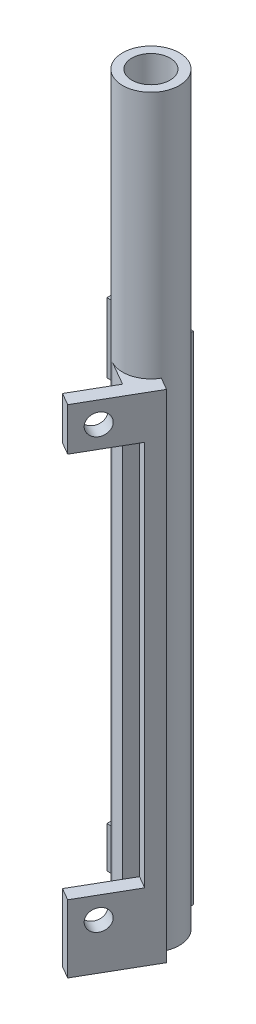
ISO-10303-21;
HEADER;
FILE_DESCRIPTION(('STEP AP214'),'2;1');
FILE_NAME('part.step','',(''),(''),'','','');
FILE_SCHEMA(('AUTOMOTIVE_DESIGN { 1 0 10303 214 1 1 1 1 }'));
ENDSEC;
DATA;
#1=APPLICATION_CONTEXT('core data for automotive mechanical design processes');
#2=APPLICATION_PROTOCOL_DEFINITION('international standard','automotive_design',2000,#1);
#3=PRODUCT_CONTEXT('',#1,'mechanical');
#4=PRODUCT('Part','Part','',(#3));
#5=PRODUCT_RELATED_PRODUCT_CATEGORY('part','',(#4));
#6=PRODUCT_DEFINITION_FORMATION('','',#4);
#7=PRODUCT_DEFINITION_CONTEXT('part definition',#1,'design');
#8=PRODUCT_DEFINITION('design','',#6,#7);
#9=PRODUCT_DEFINITION_SHAPE('','',#8);
#10=(LENGTH_UNIT() NAMED_UNIT(*) SI_UNIT(.MILLI.,.METRE.));
#11=(NAMED_UNIT(*) PLANE_ANGLE_UNIT() SI_UNIT($,.RADIAN.));
#12=(NAMED_UNIT(*) SI_UNIT($,.STERADIAN.) SOLID_ANGLE_UNIT());
#13=UNCERTAINTY_MEASURE_WITH_UNIT(LENGTH_MEASURE(1.E-05),#10,'distance_accuracy_value','');
#14=(GEOMETRIC_REPRESENTATION_CONTEXT(3) GLOBAL_UNCERTAINTY_ASSIGNED_CONTEXT((#13)) GLOBAL_UNIT_ASSIGNED_CONTEXT((#10,
#11,#12)) REPRESENTATION_CONTEXT('',''));
#15=CARTESIAN_POINT('',(0.,0.,0.));
#16=DIRECTION('',(0.,0.,1.));
#17=DIRECTION('',(1.,0.,0.));
#18=AXIS2_PLACEMENT_3D('',#15,#16,#17);
#19=CARTESIAN_POINT('',(4.39940905122498,0.,2.54000000000002));
#20=DIRECTION('',(0.866025403784439,0.,0.5));
#21=DIRECTION('',(0.5,0.,-0.866025403784438));
#22=AXIS2_PLACEMENT_3D('',#19,#20,#21);
#23=PLANE('',#22);
#24=CARTESIAN_POINT('',(-0.0455909487750237,85.09,10.2389658396437));
#25=DIRECTION('',(0.866025403784439,0.,0.5));
#26=DIRECTION('',(0.5,0.,-0.866025403784438));
#27=AXIS2_PLACEMENT_3D('',#24,#25,#26);
#28=CIRCLE('',#27,1.90500000000001);
#29=CARTESIAN_POINT('',(0.906909051224983,85.09,8.5891874454343));
#30=VERTEX_POINT('',#29);
#31=EDGE_CURVE('E40',#30,#30,#28,.T.);
#32=ORIENTED_EDGE('',*,*,#31,.T.);
#33=EDGE_LOOP('',(#32));
#34=FACE_BOUND('',#33,.T.);
#35=DIRECTION('',(0.,-1.,0.));
#36=VECTOR('',#35,1.);
#37=CARTESIAN_POINT('',(1.85940905122498,0.,6.93940905122495));
#38=LINE('',#37,#36);
#39=CARTESIAN_POINT('',(1.85940905122498,88.9,6.93940905122495));
#40=VERTEX_POINT('',#39);
#41=CARTESIAN_POINT('',(1.85940905122495,81.2165,6.93940905122493));
#42=VERTEX_POINT('',#41);
#43=EDGE_CURVE('E286',#40,#42,#38,.T.);
#44=ORIENTED_EDGE('',*,*,#43,.T.);
#45=DIRECTION('',(-0.499999999999998,0.,0.86602540378444));
#46=VECTOR('',#45,1.);
#47=CARTESIAN_POINT('',(-2.07759094877504,81.2165,13.7584930806236));
#48=LINE('',#47,#46);
#49=CARTESIAN_POINT('',(-2.07759094877504,81.2165,13.7584930806236));
#50=VERTEX_POINT('',#49);
#51=EDGE_CURVE('E210',#42,#50,#48,.T.);
#52=ORIENTED_EDGE('',*,*,#51,.T.);
#53=DIRECTION('',(0.,-1.,0.));
#54=VECTOR('',#53,1.);
#55=CARTESIAN_POINT('',(-2.07759094877502,0.,13.7584930806236));
#56=LINE('',#55,#54);
#57=CARTESIAN_POINT('',(-2.07759094877502,88.9,13.7584930806236));
#58=VERTEX_POINT('',#57);
#59=EDGE_CURVE('E279',#58,#50,#56,.T.);
#60=ORIENTED_EDGE('',*,*,#59,.F.);
#61=DIRECTION('',(0.5,0.,-0.866025403784438));
#62=VECTOR('',#61,1.);
#63=CARTESIAN_POINT('',(1.85940905122498,88.9,6.93940905122495));
#64=LINE('',#63,#62);
#65=EDGE_CURVE('E292',#58,#40,#64,.T.);
#66=ORIENTED_EDGE('',*,*,#65,.T.);
#67=EDGE_LOOP('',(#44,#52,#60,#66));
#68=FACE_BOUND('',#67,.T.);
#69=ADVANCED_FACE('F36',(#34,#68),#23,.F.);
#70=CARTESIAN_POINT('',(-6.47699999999999,0.,11.2184930806236));
#71=DIRECTION('',(-0.499999999999999,0.,0.866025403784439));
#72=DIRECTION('',(0.866025403784439,0.,0.499999999999999));
#73=AXIS2_PLACEMENT_3D('',#70,#71,#72);
#74=PLANE('',#73);
#75=DIRECTION('',(0.86602540378444,0.,0.499999999999998));
#76=VECTOR('',#75,1.);
#77=CARTESIAN_POINT('',(-2.07759094877504,81.2165,13.7584930806236));
#78=LINE('',#77,#76);
#79=CARTESIAN_POINT('',(0.122113576837438,81.2165,15.0284930806236));
#80=VERTEX_POINT('',#79);
#81=EDGE_CURVE('E220',#50,#80,#78,.T.);
#82=ORIENTED_EDGE('',*,*,#81,.T.);
#83=DIRECTION('',(0.,1.,0.));
#84=VECTOR('',#83,1.);
#85=CARTESIAN_POINT('',(0.122113576837431,0.,15.0284930806236));
#86=LINE('',#85,#84);
#87=CARTESIAN_POINT('',(0.122113576837425,88.9,15.0284930806236));
#88=VERTEX_POINT('',#87);
#89=EDGE_CURVE('E271',#80,#88,#86,.T.);
#90=ORIENTED_EDGE('',*,*,#89,.T.);
#91=DIRECTION('',(-0.866025403784439,0.,-0.499999999999999));
#92=VECTOR('',#91,1.);
#93=CARTESIAN_POINT('',(0.122113576837425,88.9,15.0284930806236));
#94=LINE('',#93,#92);
#95=EDGE_CURVE('E275',#88,#58,#94,.T.);
#96=ORIENTED_EDGE('',*,*,#95,.T.);
#97=ORIENTED_EDGE('',*,*,#59,.T.);
#98=EDGE_LOOP('',(#82,#90,#96,#97));
#99=FACE_BOUND('',#98,.T.);
#100=ADVANCED_FACE('F401',(#99),#74,.T.);
#101=CARTESIAN_POINT('',(0.,0.,-5.08));
#102=DIRECTION('',(0.,0.,1.));
#103=DIRECTION('',(1.,0.,0.));
#104=AXIS2_PLACEMENT_3D('',#101,#102,#103);
#105=PLANE('',#104);
#106=DIRECTION('',(-1.,0.,0.));
#107=VECTOR('',#106,1.);
#108=CARTESIAN_POINT('',(-12.954,76.454,-5.08));
#109=LINE('',#108,#107);
#110=CARTESIAN_POINT('',(-5.08,76.454,-5.08));
#111=VERTEX_POINT('',#110);
#112=CARTESIAN_POINT('',(-12.954,76.454,-5.08));
#113=VERTEX_POINT('',#112);
#114=EDGE_CURVE('E242',#111,#113,#109,.T.);
#115=ORIENTED_EDGE('',*,*,#114,.F.);
#116=DIRECTION('',(0.,1.,0.));
#117=VECTOR('',#116,1.);
#118=CARTESIAN_POINT('',(-5.08000000000001,88.9,-5.08));
#119=LINE('',#118,#117);
#120=CARTESIAN_POINT('',(-5.08000000000001,88.9,-5.08));
#121=VERTEX_POINT('',#120);
#122=EDGE_CURVE('E301',#111,#121,#119,.T.);
#123=ORIENTED_EDGE('',*,*,#122,.T.);
#124=DIRECTION('',(-1.,0.,0.));
#125=VECTOR('',#124,1.);
#126=CARTESIAN_POINT('',(-11.684,88.9,-5.08));
#127=LINE('',#126,#125);
#128=CARTESIAN_POINT('',(-12.954,88.9,-5.08));
#129=VERTEX_POINT('',#128);
#130=EDGE_CURVE('E305',#121,#129,#127,.T.);
#131=ORIENTED_EDGE('',*,*,#130,.T.);
#132=DIRECTION('',(0.,1.,0.));
#133=VECTOR('',#132,1.);
#134=CARTESIAN_POINT('',(-12.954,0.,-5.08));
#135=LINE('',#134,#133);
#136=EDGE_CURVE('E257',#113,#129,#135,.T.);
#137=ORIENTED_EDGE('',*,*,#136,.F.);
#138=EDGE_LOOP('',(#115,#123,#131,#137));
#139=FACE_BOUND('',#138,.T.);
#140=CARTESIAN_POINT('',(-8.89,80.01,-5.08));
#141=DIRECTION('',(0.,0.,1.));
#142=DIRECTION('',(1.,0.,0.));
#143=AXIS2_PLACEMENT_3D('',#140,#141,#142);
#144=CIRCLE('',#143,1.90500000000002);
#145=CARTESIAN_POINT('',(-6.98499999999998,80.01,-5.08));
#146=VERTEX_POINT('',#145);
#147=EDGE_CURVE('E308',#146,#146,#144,.F.);
#148=ORIENTED_EDGE('',*,*,#147,.T.);
#149=EDGE_LOOP('',(#148));
#150=FACE_BOUND('',#149,.T.);
#151=ADVANCED_FACE('F383',(#139,#150),#105,.T.);
#152=CARTESIAN_POINT('',(-12.954,0.,0.));
#153=DIRECTION('',(-1.,0.,0.));
#154=DIRECTION('',(0.,0.,1.));
#155=AXIS2_PLACEMENT_3D('',#152,#153,#154);
#156=PLANE('',#155);
#157=DIRECTION('',(0.,0.,1.));
#158=VECTOR('',#157,1.);
#159=CARTESIAN_POINT('',(-12.954,76.454,-7.62));
#160=LINE('',#159,#158);
#161=CARTESIAN_POINT('',(-12.954,76.454,-7.62));
#162=VERTEX_POINT('',#161);
#163=EDGE_CURVE('E245',#162,#113,#160,.T.);
#164=ORIENTED_EDGE('',*,*,#163,.T.);
#165=ORIENTED_EDGE('',*,*,#136,.T.);
#166=DIRECTION('',(0.,0.,-1.));
#167=VECTOR('',#166,1.);
#168=CARTESIAN_POINT('',(-12.954,88.9,-5.08));
#169=LINE('',#168,#167);
#170=CARTESIAN_POINT('',(-12.954,88.9,-7.62));
#171=VERTEX_POINT('',#170);
#172=EDGE_CURVE('E261',#129,#171,#169,.T.);
#173=ORIENTED_EDGE('',*,*,#172,.T.);
#174=DIRECTION('',(0.,-1.,0.));
#175=VECTOR('',#174,1.);
#176=CARTESIAN_POINT('',(-12.954,0.,-7.62));
#177=LINE('',#176,#175);
#178=EDGE_CURVE('E265',#171,#162,#177,.T.);
#179=ORIENTED_EDGE('',*,*,#178,.T.);
#180=EDGE_LOOP('',(#164,#165,#173,#179));
#181=FACE_BOUND('',#180,.T.);
#182=ADVANCED_FACE('F396',(#181),#156,.T.);
#183=CARTESIAN_POINT('',(-8.89,3.81,-10.161));
#184=DIRECTION('',(0.,0.,1.));
#185=DIRECTION('',(1.,0.,0.));
#186=AXIS2_PLACEMENT_3D('',#183,#184,#185);
#187=CYLINDRICAL_SURFACE('',#186,1.905);
#188=CARTESIAN_POINT('',(-8.89,3.81,-7.62));
#189=DIRECTION('',(0.,0.,1.));
#190=DIRECTION('',(1.,0.,0.));
#191=AXIS2_PLACEMENT_3D('',#188,#189,#190);
#192=CIRCLE('',#191,1.905);
#193=CARTESIAN_POINT('',(-6.985,3.81,-7.62));
#194=VERTEX_POINT('',#193);
#195=EDGE_CURVE('E331',#194,#194,#192,.F.);
#196=ORIENTED_EDGE('',*,*,#195,.T.);
#197=EDGE_LOOP('',(#196));
#198=FACE_BOUND('',#197,.T.);
#199=CARTESIAN_POINT('',(-8.89,3.81,-5.08));
#200=DIRECTION('',(0.,0.,1.));
#201=DIRECTION('',(1.,0.,0.));
#202=AXIS2_PLACEMENT_3D('',#199,#200,#201);
#203=CIRCLE('',#202,1.905);
#204=CARTESIAN_POINT('',(-6.985,3.81,-5.08));
#205=VERTEX_POINT('',#204);
#206=EDGE_CURVE('E309',#205,#205,#203,.F.);
#207=ORIENTED_EDGE('',*,*,#206,.F.);
#208=EDGE_LOOP('',(#207));
#209=FACE_BOUND('',#208,.T.);
#210=ADVANCED_FACE('F387',(#198,#209),#187,.F.);
#211=CARTESIAN_POINT('',(-8.89,80.01,-10.161));
#212=DIRECTION('',(0.,0.,1.));
#213=DIRECTION('',(1.,0.,0.));
#214=AXIS2_PLACEMENT_3D('',#211,#212,#213);
#215=CYLINDRICAL_SURFACE('',#214,1.90500000000002);
#216=CARTESIAN_POINT('',(-8.89,80.01,-7.62));
#217=DIRECTION('',(0.,0.,1.));
#218=DIRECTION('',(1.,0.,0.));
#219=AXIS2_PLACEMENT_3D('',#216,#217,#218);
#220=CIRCLE('',#219,1.90500000000002);
#221=CARTESIAN_POINT('',(-6.98499999999998,80.01,-7.62));
#222=VERTEX_POINT('',#221);
#223=EDGE_CURVE('E330',#222,#222,#220,.F.);
#224=ORIENTED_EDGE('',*,*,#223,.T.);
#225=EDGE_LOOP('',(#224));
#226=FACE_BOUND('',#225,.T.);
#227=ORIENTED_EDGE('',*,*,#147,.F.);
#228=EDGE_LOOP('',(#227));
#229=FACE_BOUND('',#228,.T.);
#230=ADVANCED_FACE('F385',(#226,#229),#215,.F.);
#231=CARTESIAN_POINT('',(0.,133.35,0.));
#232=DIRECTION('',(0.,-1.,0.));
#233=DIRECTION('',(0.,0.,-1.));
#234=AXIS2_PLACEMENT_3D('',#231,#232,#233);
#235=CYLINDRICAL_SURFACE('',#234,5.08);
#236=DIRECTION('',(0.,-1.,0.));
#237=VECTOR('',#236,1.);
#238=CARTESIAN_POINT('',(0.,88.9,-5.08));
#239=LINE('',#238,#237);
#240=CARTESIAN_POINT('',(0.,88.9,-5.08));
#241=VERTEX_POINT('',#240);
#242=CARTESIAN_POINT('',(0.,0.,-5.08));
#243=VERTEX_POINT('',#242);
#244=EDGE_CURVE('E355',#241,#243,#239,.T.);
#245=ORIENTED_EDGE('',*,*,#244,.F.);
#246=CARTESIAN_POINT('',(0.,88.9,0.));
#247=DIRECTION('',(0.,1.,0.));
#248=DIRECTION('',(0.,0.,1.));
#249=AXIS2_PLACEMENT_3D('',#246,#247,#248);
#250=CIRCLE('',#249,5.08);
#251=CARTESIAN_POINT('',(-5.08,88.9,0.));
#252=VERTEX_POINT('',#251);
#253=EDGE_CURVE('E367',#241,#252,#250,.T.);
#254=ORIENTED_EDGE('',*,*,#253,.T.);
#255=DIRECTION('',(0.,-1.,0.));
#256=VECTOR('',#255,1.);
#257=CARTESIAN_POINT('',(-5.08,88.9,0.));
#258=LINE('',#257,#256);
#259=CARTESIAN_POINT('',(-5.08,0.,0.));
#260=VERTEX_POINT('',#259);
#261=EDGE_CURVE('E359',#252,#260,#258,.T.);
#262=ORIENTED_EDGE('',*,*,#261,.T.);
#263=CARTESIAN_POINT('',(0.,0.,0.));
#264=DIRECTION('',(0.,1.,0.));
#265=DIRECTION('',(0.,0.,1.));
#266=AXIS2_PLACEMENT_3D('',#263,#264,#265);
#267=CIRCLE('',#266,5.08);
#268=CARTESIAN_POINT('',(-2.53999999999999,0.,4.39940905122496));
#269=VERTEX_POINT('',#268);
#270=EDGE_CURVE('E371',#260,#269,#267,.T.);
#271=ORIENTED_EDGE('',*,*,#270,.T.);
#272=DIRECTION('',(0.,-1.,0.));
#273=VECTOR('',#272,1.);
#274=CARTESIAN_POINT('',(-2.53999999999998,88.9,4.39940905122496));
#275=LINE('',#274,#273);
#276=CARTESIAN_POINT('',(-2.53999999999998,88.9,4.39940905122496));
#277=VERTEX_POINT('',#276);
#278=EDGE_CURVE('E362',#277,#269,#275,.T.);
#279=ORIENTED_EDGE('',*,*,#278,.F.);
#280=CARTESIAN_POINT('',(4.39940905122495,88.9,2.53999999999999));
#281=VERTEX_POINT('',#280);
#282=EDGE_CURVE('E358',#277,#281,#250,.T.);
#283=ORIENTED_EDGE('',*,*,#282,.T.);
#284=DIRECTION('',(0.,-1.,0.));
#285=VECTOR('',#284,1.);
#286=CARTESIAN_POINT('',(4.39940905122493,88.9,2.53999999999998));
#287=LINE('',#286,#285);
#288=CARTESIAN_POINT('',(4.39940905122493,0.,2.53999999999998));
#289=VERTEX_POINT('',#288);
#290=EDGE_CURVE('E351',#281,#289,#287,.T.);
#291=ORIENTED_EDGE('',*,*,#290,.T.);
#292=EDGE_CURVE('E45',#289,#243,#267,.T.);
#293=ORIENTED_EDGE('',*,*,#292,.T.);
#294=EDGE_LOOP('',(#245,#254,#262,#271,#279,#283,#291,#293));
#295=FACE_BOUND('',#294,.T.);
#296=CARTESIAN_POINT('',(0.,133.35,0.));
#297=DIRECTION('',(0.,1.,0.));
#298=DIRECTION('',(0.,0.,1.));
#299=AXIS2_PLACEMENT_3D('',#296,#297,#298);
#300=CIRCLE('',#299,5.08);
#301=CARTESIAN_POINT('',(0.,133.35,5.08));
#302=VERTEX_POINT('',#301);
#303=EDGE_CURVE('E11',#302,#302,#300,.T.);
#304=ORIENTED_EDGE('',*,*,#303,.F.);
#305=EDGE_LOOP('',(#304));
#306=FACE_BOUND('',#305,.T.);
#307=ADVANCED_FACE('F38',(#295,#306),#235,.T.);
#308=CARTESIAN_POINT('',(0.,133.35,0.));
#309=DIRECTION('',(0.,1.,0.));
#310=DIRECTION('',(0.,0.,1.));
#311=AXIS2_PLACEMENT_3D('',#308,#309,#310);
#312=PLANE('',#311);
#313=CARTESIAN_POINT('',(0.,133.35,0.));
#314=DIRECTION('',(0.,-1.,0.));
#315=DIRECTION('',(0.,0.,-1.));
#316=AXIS2_PLACEMENT_3D('',#313,#314,#315);
#317=CIRCLE('',#316,3.429);
#318=CARTESIAN_POINT('',(0.,133.35,-3.429));
#319=VERTEX_POINT('',#318);
#320=EDGE_CURVE('E368',#319,#319,#317,.T.);
#321=ORIENTED_EDGE('',*,*,#320,.T.);
#322=EDGE_LOOP('',(#321));
#323=FACE_BOUND('',#322,.T.);
#324=ORIENTED_EDGE('',*,*,#303,.T.);
#325=EDGE_LOOP('',(#324));
#326=FACE_BOUND('',#325,.T.);
#327=ADVANCED_FACE('F394',(#323,#326),#312,.T.);
#328=CARTESIAN_POINT('',(0.,0.,0.));
#329=DIRECTION('',(0.,1.,0.));
#330=DIRECTION('',(0.,0.,1.));
#331=AXIS2_PLACEMENT_3D('',#328,#329,#330);
#332=PLANE('',#331);
#333=CARTESIAN_POINT('',(0.,0.,0.));
#334=DIRECTION('',(0.,-1.,0.));
#335=DIRECTION('',(0.,0.,-1.));
#336=AXIS2_PLACEMENT_3D('',#333,#334,#335);
#337=CIRCLE('',#336,3.429);
#338=CARTESIAN_POINT('',(0.,0.,-3.429));
#339=VERTEX_POINT('',#338);
#340=EDGE_CURVE('E372',#339,#339,#337,.T.);
#341=ORIENTED_EDGE('',*,*,#340,.F.);
#342=EDGE_LOOP('',(#341));
#343=FACE_BOUND('',#342,.T.);
#344=DIRECTION('',(-0.500000000000001,0.,0.866025403784438));
#345=VECTOR('',#344,1.);
#346=CARTESIAN_POINT('',(1.85940905122498,0.,6.93940905122495));
#347=LINE('',#346,#345);
#348=CARTESIAN_POINT('',(1.85940905122498,0.,6.93940905122495));
#349=VERTEX_POINT('',#348);
#350=CARTESIAN_POINT('',(-2.07759094877502,0.,13.7584930806236));
#351=VERTEX_POINT('',#350);
#352=EDGE_CURVE('E289',#349,#351,#347,.T.);
#353=ORIENTED_EDGE('',*,*,#352,.F.);
#354=DIRECTION('',(0.86602540378444,0.,0.499999999999997));
#355=VECTOR('',#354,1.);
#356=CARTESIAN_POINT('',(1.41946814610249,0.,6.68540905122495));
#357=LINE('',#356,#355);
#358=EDGE_CURVE('E335',#269,#349,#357,.T.);
#359=ORIENTED_EDGE('',*,*,#358,.F.);
#360=ORIENTED_EDGE('',*,*,#270,.F.);
#361=DIRECTION('',(0.,0.,1.));
#362=VECTOR('',#361,1.);
#363=CARTESIAN_POINT('',(-5.08,0.,-4.572));
#364=LINE('',#363,#362);
#365=CARTESIAN_POINT('',(-5.08,0.,-5.08));
#366=VERTEX_POINT('',#365);
#367=EDGE_CURVE('E339',#366,#260,#364,.T.);
#368=ORIENTED_EDGE('',*,*,#367,.F.);
#369=DIRECTION('',(1.,0.,0.));
#370=VECTOR('',#369,1.);
#371=CARTESIAN_POINT('',(-11.684,0.,-5.08));
#372=LINE('',#371,#370);
#373=CARTESIAN_POINT('',(-12.954,0.,-5.08));
#374=VERTEX_POINT('',#373);
#375=EDGE_CURVE('E298',#374,#366,#372,.T.);
#376=ORIENTED_EDGE('',*,*,#375,.F.);
#377=DIRECTION('',(0.,0.,1.));
#378=VECTOR('',#377,1.);
#379=CARTESIAN_POINT('',(-12.954,0.,-5.08));
#380=LINE('',#379,#378);
#381=CARTESIAN_POINT('',(-12.954,0.,-7.62));
#382=VERTEX_POINT('',#381);
#383=EDGE_CURVE('E268',#382,#374,#380,.T.);
#384=ORIENTED_EDGE('',*,*,#383,.F.);
#385=DIRECTION('',(-1.,0.,0.));
#386=VECTOR('',#385,1.);
#387=CARTESIAN_POINT('',(-11.684,0.,-7.62));
#388=LINE('',#387,#386);
#389=CARTESIAN_POINT('',(0.,0.,-7.62));
#390=VERTEX_POINT('',#389);
#391=EDGE_CURVE('E327',#390,#382,#388,.T.);
#392=ORIENTED_EDGE('',*,*,#391,.F.);
#393=DIRECTION('',(0.,0.,1.));
#394=VECTOR('',#393,1.);
#395=CARTESIAN_POINT('',(0.,0.,-10.16));
#396=LINE('',#395,#394);
#397=EDGE_CURVE('E349',#390,#243,#396,.T.);
#398=ORIENTED_EDGE('',*,*,#397,.T.);
#399=ORIENTED_EDGE('',*,*,#292,.F.);
#400=DIRECTION('',(0.86602540378444,0.,0.499999999999998));
#401=VECTOR('',#400,1.);
#402=CARTESIAN_POINT('',(4.39940905122493,0.,2.53999999999998));
#403=LINE('',#402,#401);
#404=CARTESIAN_POINT('',(6.59911357683741,0.,3.80999999999997));
#405=VERTEX_POINT('',#404);
#406=EDGE_CURVE('E341',#289,#405,#403,.T.);
#407=ORIENTED_EDGE('',*,*,#406,.T.);
#408=DIRECTION('',(0.499999999999998,0.,-0.86602540378444));
#409=VECTOR('',#408,1.);
#410=CARTESIAN_POINT('',(0.757113576837431,0.,13.9286408178174));
#411=LINE('',#410,#409);
#412=CARTESIAN_POINT('',(0.122113576837431,0.,15.0284930806236));
#413=VERTEX_POINT('',#412);
#414=EDGE_CURVE('E312',#413,#405,#411,.T.);
#415=ORIENTED_EDGE('',*,*,#414,.F.);
#416=DIRECTION('',(0.866025403784439,0.,0.499999999999999));
#417=VECTOR('',#416,1.);
#418=CARTESIAN_POINT('',(0.122113576837431,0.,15.0284930806236));
#419=LINE('',#418,#417);
#420=EDGE_CURVE('E282',#351,#413,#419,.T.);
#421=ORIENTED_EDGE('',*,*,#420,.F.);
#422=EDGE_LOOP('',(#353,#359,#360,#368,#376,#384,#392,#398,#399,#407,#415,#421));
#423=FACE_BOUND('',#422,.T.);
#424=ADVANCED_FACE('F447',(#343,#423),#332,.F.);
#425=CARTESIAN_POINT('',(0.,133.35,0.));
#426=DIRECTION('',(0.,-1.,0.));
#427=DIRECTION('',(0.,0.,-1.));
#428=AXIS2_PLACEMENT_3D('',#425,#426,#427);
#429=CYLINDRICAL_SURFACE('',#428,3.429);
#430=ORIENTED_EDGE('',*,*,#340,.T.);
#431=EDGE_LOOP('',(#430));
#432=FACE_BOUND('',#431,.T.);
#433=ORIENTED_EDGE('',*,*,#320,.F.);
#434=EDGE_LOOP('',(#433));
#435=FACE_BOUND('',#434,.T.);
#436=ADVANCED_FACE('F556',(#432,#435),#429,.F.);
#437=CARTESIAN_POINT('',(0.,88.9,0.));
#438=DIRECTION('',(0.,1.,0.));
#439=DIRECTION('',(0.,0.,1.));
#440=AXIS2_PLACEMENT_3D('',#437,#438,#439);
#441=PLANE('',#440);
#442=DIRECTION('',(0.86602540378444,0.,0.499999999999997));
#443=VECTOR('',#442,1.);
#444=CARTESIAN_POINT('',(1.41946814610249,88.9,6.68540905122495));
#445=LINE('',#444,#443);
#446=EDGE_CURVE('E338',#277,#40,#445,.T.);
#447=ORIENTED_EDGE('',*,*,#446,.T.);
#448=ORIENTED_EDGE('',*,*,#65,.F.);
#449=ORIENTED_EDGE('',*,*,#95,.F.);
#450=DIRECTION('',(-0.499999999999998,0.,0.86602540378444));
#451=VECTOR('',#450,1.);
#452=CARTESIAN_POINT('',(0.757113576837431,88.9,13.9286408178174));
#453=LINE('',#452,#451);
#454=CARTESIAN_POINT('',(6.59911357683741,88.9,3.80999999999997));
#455=VERTEX_POINT('',#454);
#456=EDGE_CURVE('E316',#455,#88,#453,.T.);
#457=ORIENTED_EDGE('',*,*,#456,.F.);
#458=DIRECTION('',(0.86602540378444,0.,0.499999999999998));
#459=VECTOR('',#458,1.);
#460=CARTESIAN_POINT('',(4.39940905122493,88.9,2.53999999999998));
#461=LINE('',#460,#459);
#462=EDGE_CURVE('E345',#281,#455,#461,.T.);
#463=ORIENTED_EDGE('',*,*,#462,.F.);
#464=ORIENTED_EDGE('',*,*,#282,.F.);
#465=EDGE_LOOP('',(#447,#448,#449,#457,#463,#464));
#466=FACE_BOUND('',#465,.T.);
#467=ADVANCED_FACE('F457',(#466),#441,.T.);
#468=CARTESIAN_POINT('',(4.39940905122493,88.9,2.53999999999998));
#469=DIRECTION('',(0.499999999999998,0.,-0.86602540378444));
#470=DIRECTION('',(-0.86602540378444,0.,-0.499999999999998));
#471=AXIS2_PLACEMENT_3D('',#468,#469,#470);
#472=PLANE('',#471);
#473=DIRECTION('',(0.,1.,0.));
#474=VECTOR('',#473,1.);
#475=CARTESIAN_POINT('',(6.59911357683741,0.,3.80999999999998));
#476=LINE('',#475,#474);
#477=EDGE_CURVE('E314',#405,#455,#476,.T.);
#478=ORIENTED_EDGE('',*,*,#477,.F.);
#479=ORIENTED_EDGE('',*,*,#406,.F.);
#480=ORIENTED_EDGE('',*,*,#290,.F.);
#481=ORIENTED_EDGE('',*,*,#462,.T.);
#482=EDGE_LOOP('',(#478,#479,#480,#481));
#483=FACE_BOUND('',#482,.T.);
#484=ADVANCED_FACE('F452',(#483),#472,.T.);
#485=ORIENTED_EDGE('',*,*,#130,.F.);
#486=DIRECTION('',(0.,0.,1.));
#487=VECTOR('',#486,1.);
#488=CARTESIAN_POINT('',(-5.08,88.9,-4.572));
#489=LINE('',#488,#487);
#490=EDGE_CURVE('E334',#121,#252,#489,.T.);
#491=ORIENTED_EDGE('',*,*,#490,.T.);
#492=ORIENTED_EDGE('',*,*,#253,.F.);
#493=DIRECTION('',(0.,0.,1.));
#494=VECTOR('',#493,1.);
#495=CARTESIAN_POINT('',(0.,88.9,-10.16));
#496=LINE('',#495,#494);
#497=CARTESIAN_POINT('',(0.,88.9,-7.62));
#498=VERTEX_POINT('',#497);
#499=EDGE_CURVE('E348',#498,#241,#496,.T.);
#500=ORIENTED_EDGE('',*,*,#499,.F.);
#501=DIRECTION('',(1.,0.,0.));
#502=VECTOR('',#501,1.);
#503=CARTESIAN_POINT('',(-11.684,88.9,-7.62));
#504=LINE('',#503,#502);
#505=EDGE_CURVE('E323',#171,#498,#504,.T.);
#506=ORIENTED_EDGE('',*,*,#505,.F.);
#507=ORIENTED_EDGE('',*,*,#172,.F.);
#508=EDGE_LOOP('',(#485,#491,#492,#500,#506,#507));
#509=FACE_BOUND('',#508,.T.);
#510=ADVANCED_FACE('F482',(#509),#441,.T.);
#511=CARTESIAN_POINT('',(0.,88.9,-10.16));
#512=DIRECTION('',(1.,0.,0.));
#513=DIRECTION('',(0.,0.,-1.));
#514=AXIS2_PLACEMENT_3D('',#511,#512,#513);
#515=PLANE('',#514);
#516=DIRECTION('',(0.,-1.,0.));
#517=VECTOR('',#516,1.);
#518=CARTESIAN_POINT('',(0.,88.9,-7.62));
#519=LINE('',#518,#517);
#520=EDGE_CURVE('E325',#498,#390,#519,.T.);
#521=ORIENTED_EDGE('',*,*,#520,.F.);
#522=ORIENTED_EDGE('',*,*,#499,.T.);
#523=ORIENTED_EDGE('',*,*,#244,.T.);
#524=ORIENTED_EDGE('',*,*,#397,.F.);
#525=EDGE_LOOP('',(#521,#522,#523,#524));
#526=FACE_BOUND('',#525,.T.);
#527=ADVANCED_FACE('F477',(#526),#515,.T.);
#528=CARTESIAN_POINT('',(8.73650111515179,8.255,15.3093090567999));
#529=DIRECTION('',(-0.86602540378444,0.,-0.499999999999998));
#530=DIRECTION('',(-0.499999999999998,0.,0.86602540378444));
#531=AXIS2_PLACEMENT_3D('',#528,#529,#530);
#532=CYLINDRICAL_SURFACE('',#531,1.905);
#533=CARTESIAN_POINT('',(-0.0455909487750202,8.255,10.2389658396437));
#534=DIRECTION('',(0.866025403784439,0.,0.5));
#535=DIRECTION('',(0.5,0.,-0.866025403784438));
#536=AXIS2_PLACEMENT_3D('',#533,#534,#535);
#537=CIRCLE('',#536,1.905);
#538=CARTESIAN_POINT('',(0.906909051224981,8.255,8.58918744543431));
#539=VERTEX_POINT('',#538);
#540=EDGE_CURVE('E295',#539,#539,#537,.T.);
#541=ORIENTED_EDGE('',*,*,#540,.F.);
#542=EDGE_LOOP('',(#541));
#543=FACE_BOUND('',#542,.T.);
#544=CARTESIAN_POINT('',(2.15411357683743,8.255,11.5089658396436));
#545=DIRECTION('',(-0.86602540378444,0.,-0.499999999999998));
#546=DIRECTION('',(-0.499999999999998,0.,0.86602540378444));
#547=AXIS2_PLACEMENT_3D('',#544,#545,#546);
#548=CIRCLE('',#547,1.905);
#549=CARTESIAN_POINT('',(1.20161357683743,8.255,13.158744233853));
#550=VERTEX_POINT('',#549);
#551=EDGE_CURVE('E320',#550,#550,#548,.T.);
#552=ORIENTED_EDGE('',*,*,#551,.F.);
#553=EDGE_LOOP('',(#552));
#554=FACE_BOUND('',#553,.T.);
#555=ADVANCED_FACE('F536',(#543,#554),#532,.F.);
#556=CARTESIAN_POINT('',(8.73650111515179,85.09,15.3093090567999));
#557=DIRECTION('',(-0.86602540378444,0.,-0.499999999999998));
#558=DIRECTION('',(-0.499999999999998,0.,0.86602540378444));
#559=AXIS2_PLACEMENT_3D('',#556,#557,#558);
#560=CYLINDRICAL_SURFACE('',#559,1.90500000000001);
#561=ORIENTED_EDGE('',*,*,#31,.F.);
#562=EDGE_LOOP('',(#561));
#563=FACE_BOUND('',#562,.T.);
#564=CARTESIAN_POINT('',(2.15411357683743,85.09,11.5089658396436));
#565=DIRECTION('',(-0.86602540378444,0.,-0.499999999999998));
#566=DIRECTION('',(-0.499999999999998,0.,0.86602540378444));
#567=AXIS2_PLACEMENT_3D('',#564,#565,#566);
#568=CIRCLE('',#567,1.90500000000001);
#569=CARTESIAN_POINT('',(1.20161357683742,85.09,13.158744233853));
#570=VERTEX_POINT('',#569);
#571=EDGE_CURVE('E319',#570,#570,#568,.T.);
#572=ORIENTED_EDGE('',*,*,#571,.F.);
#573=EDGE_LOOP('',(#572));
#574=FACE_BOUND('',#573,.T.);
#575=ADVANCED_FACE('F532',(#563,#574),#560,.F.);
#576=CARTESIAN_POINT('',(1.41946814610249,133.351,6.68540905122495));
#577=DIRECTION('',(0.499999999999997,0.,-0.86602540378444));
#578=DIRECTION('',(-0.86602540378444,0.,-0.499999999999997));
#579=AXIS2_PLACEMENT_3D('',#576,#577,#578);
#580=PLANE('',#579);
#581=ORIENTED_EDGE('',*,*,#278,.T.);
#582=ORIENTED_EDGE('',*,*,#358,.T.);
#583=CARTESIAN_POINT('',(1.85940905122495,12.1285,6.93940905122493));
#584=VERTEX_POINT('',#583);
#585=EDGE_CURVE('E285',#584,#349,#38,.T.);
#586=ORIENTED_EDGE('',*,*,#585,.F.);
#587=DIRECTION('',(0.,-1.,0.));
#588=VECTOR('',#587,1.);
#589=CARTESIAN_POINT('',(1.85940905122495,133.351,6.93940905122493));
#590=LINE('',#589,#588);
#591=EDGE_CURVE('E195',#42,#584,#590,.T.);
#592=ORIENTED_EDGE('',*,*,#591,.F.);
#593=ORIENTED_EDGE('',*,*,#43,.F.);
#594=ORIENTED_EDGE('',*,*,#446,.F.);
#595=EDGE_LOOP('',(#581,#582,#586,#592,#593,#594));
#596=FACE_BOUND('',#595,.T.);
#597=ADVANCED_FACE('F441',(#596),#580,.F.);
#598=CARTESIAN_POINT('',(-5.08,133.351,-4.572));
#599=DIRECTION('',(1.,0.,0.));
#600=DIRECTION('',(0.,0.,-1.));
#601=AXIS2_PLACEMENT_3D('',#598,#599,#600);
#602=PLANE('',#601);
#603=ORIENTED_EDGE('',*,*,#490,.F.);
#604=ORIENTED_EDGE('',*,*,#122,.F.);
#605=DIRECTION('',(0.,-1.,0.));
#606=VECTOR('',#605,1.);
#607=CARTESIAN_POINT('',(-5.08,133.351,-5.08));
#608=LINE('',#607,#606);
#609=CARTESIAN_POINT('',(-5.08,7.366,-5.08));
#610=VERTEX_POINT('',#609);
#611=EDGE_CURVE('E248',#111,#610,#608,.T.);
#612=ORIENTED_EDGE('',*,*,#611,.T.);
#613=EDGE_CURVE('E302',#366,#610,#119,.T.);
#614=ORIENTED_EDGE('',*,*,#613,.F.);
#615=ORIENTED_EDGE('',*,*,#367,.T.);
#616=ORIENTED_EDGE('',*,*,#261,.F.);
#617=EDGE_LOOP('',(#603,#604,#612,#614,#615,#616));
#618=FACE_BOUND('',#617,.T.);
#619=ADVANCED_FACE('F465',(#618),#602,.F.);
#620=CARTESIAN_POINT('',(0.,0.,-7.62));
#621=DIRECTION('',(0.,0.,1.));
#622=DIRECTION('',(1.,0.,0.));
#623=AXIS2_PLACEMENT_3D('',#620,#621,#622);
#624=PLANE('',#623);
#625=ORIENTED_EDGE('',*,*,#223,.F.);
#626=EDGE_LOOP('',(#625));
#627=FACE_BOUND('',#626,.T.);
#628=DIRECTION('',(0.,1.,0.));
#629=VECTOR('',#628,1.);
#630=CARTESIAN_POINT('',(-2.8575,76.454,-7.62));
#631=LINE('',#630,#629);
#632=CARTESIAN_POINT('',(-2.8575,7.366,-7.62));
#633=VERTEX_POINT('',#632);
#634=CARTESIAN_POINT('',(-2.8575,76.454,-7.62));
#635=VERTEX_POINT('',#634);
#636=EDGE_CURVE('E228',#633,#635,#631,.T.);
#637=ORIENTED_EDGE('',*,*,#636,.T.);
#638=DIRECTION('',(-1.,0.,0.));
#639=VECTOR('',#638,1.);
#640=CARTESIAN_POINT('',(-12.954,76.454,-7.62));
#641=LINE('',#640,#639);
#642=EDGE_CURVE('E232',#635,#162,#641,.T.);
#643=ORIENTED_EDGE('',*,*,#642,.T.);
#644=ORIENTED_EDGE('',*,*,#178,.F.);
#645=ORIENTED_EDGE('',*,*,#505,.T.);
#646=ORIENTED_EDGE('',*,*,#520,.T.);
#647=ORIENTED_EDGE('',*,*,#391,.T.);
#648=CARTESIAN_POINT('',(-12.954,7.366,-7.62));
#649=VERTEX_POINT('',#648);
#650=EDGE_CURVE('E264',#649,#382,#177,.T.);
#651=ORIENTED_EDGE('',*,*,#650,.F.);
#652=DIRECTION('',(1.,0.,0.));
#653=VECTOR('',#652,1.);
#654=CARTESIAN_POINT('',(-12.954,7.366,-7.62));
#655=LINE('',#654,#653);
#656=EDGE_CURVE('E61',#649,#633,#655,.T.);
#657=ORIENTED_EDGE('',*,*,#656,.T.);
#658=EDGE_LOOP('',(#637,#643,#644,#645,#646,#647,#651,#657));
#659=FACE_BOUND('',#658,.T.);
#660=ORIENTED_EDGE('',*,*,#195,.F.);
#661=EDGE_LOOP('',(#660));
#662=FACE_BOUND('',#661,.T.);
#663=ADVANCED_FACE('F493',(#627,#659,#662),#624,.F.);
#664=CARTESIAN_POINT('',(6.59911357683741,0.,3.80999999999997));
#665=DIRECTION('',(-0.86602540378444,0.,-0.499999999999998));
#666=DIRECTION('',(-0.499999999999998,0.,0.86602540378444));
#667=AXIS2_PLACEMENT_3D('',#664,#665,#666);
#668=PLANE('',#667);
#669=ORIENTED_EDGE('',*,*,#551,.T.);
#670=EDGE_LOOP('',(#669));
#671=FACE_BOUND('',#670,.T.);
#672=ORIENTED_EDGE('',*,*,#571,.T.);
#673=EDGE_LOOP('',(#672));
#674=FACE_BOUND('',#673,.T.);
#675=ORIENTED_EDGE('',*,*,#89,.F.);
#676=DIRECTION('',(-0.499999999999998,0.,0.86602540378444));
#677=VECTOR('',#676,1.);
#678=CARTESIAN_POINT('',(0.122113576837438,81.2165,15.0284930806236));
#679=LINE('',#678,#677);
#680=CARTESIAN_POINT('',(5.17036357683742,81.2165,6.28466759131401));
#681=VERTEX_POINT('',#680);
#682=EDGE_CURVE('E196',#681,#80,#679,.T.);
#683=ORIENTED_EDGE('',*,*,#682,.F.);
#684=DIRECTION('',(0.,1.,0.));
#685=VECTOR('',#684,1.);
#686=CARTESIAN_POINT('',(5.17036357683742,81.2165,6.28466759131401));
#687=LINE('',#686,#685);
#688=CARTESIAN_POINT('',(5.17036357683742,12.1285,6.28466759131401));
#689=VERTEX_POINT('',#688);
#690=EDGE_CURVE('E217',#689,#681,#687,.T.);
#691=ORIENTED_EDGE('',*,*,#690,.F.);
#692=DIRECTION('',(0.499999999999998,0.,-0.86602540378444));
#693=VECTOR('',#692,1.);
#694=CARTESIAN_POINT('',(0.122113576837438,12.1285,15.0284930806236));
#695=LINE('',#694,#693);
#696=CARTESIAN_POINT('',(0.122113576837438,12.1285,15.0284930806236));
#697=VERTEX_POINT('',#696);
#698=EDGE_CURVE('E202',#697,#689,#695,.T.);
#699=ORIENTED_EDGE('',*,*,#698,.F.);
#700=EDGE_CURVE('E272',#413,#697,#86,.T.);
#701=ORIENTED_EDGE('',*,*,#700,.F.);
#702=ORIENTED_EDGE('',*,*,#414,.T.);
#703=ORIENTED_EDGE('',*,*,#477,.T.);
#704=ORIENTED_EDGE('',*,*,#456,.T.);
#705=EDGE_LOOP('',(#675,#683,#691,#699,#701,#702,#703,#704));
#706=FACE_BOUND('',#705,.T.);
#707=ADVANCED_FACE('F423',(#671,#674,#706),#668,.F.);
#708=DIRECTION('',(1.,0.,0.));
#709=VECTOR('',#708,1.);
#710=CARTESIAN_POINT('',(-12.954,7.366,-5.08));
#711=LINE('',#710,#709);
#712=CARTESIAN_POINT('',(-12.954,7.366,-5.08));
#713=VERTEX_POINT('',#712);
#714=EDGE_CURVE('E236',#713,#610,#711,.T.);
#715=ORIENTED_EDGE('',*,*,#714,.F.);
#716=EDGE_CURVE('E258',#374,#713,#135,.T.);
#717=ORIENTED_EDGE('',*,*,#716,.F.);
#718=ORIENTED_EDGE('',*,*,#375,.T.);
#719=ORIENTED_EDGE('',*,*,#613,.T.);
#720=EDGE_LOOP('',(#715,#717,#718,#719));
#721=FACE_BOUND('',#720,.T.);
#722=ORIENTED_EDGE('',*,*,#206,.T.);
#723=EDGE_LOOP('',(#722));
#724=FACE_BOUND('',#723,.T.);
#725=ADVANCED_FACE('F415',(#721,#724),#105,.T.);
#726=ORIENTED_EDGE('',*,*,#540,.T.);
#727=EDGE_LOOP('',(#726));
#728=FACE_BOUND('',#727,.T.);
#729=CARTESIAN_POINT('',(-2.07759094877502,12.1285,13.7584930806236));
#730=VERTEX_POINT('',#729);
#731=EDGE_CURVE('E278',#730,#351,#56,.T.);
#732=ORIENTED_EDGE('',*,*,#731,.F.);
#733=DIRECTION('',(0.499999999999998,0.,-0.86602540378444));
#734=VECTOR('',#733,1.);
#735=CARTESIAN_POINT('',(-2.07759094877504,12.1285,13.7584930806236));
#736=LINE('',#735,#734);
#737=EDGE_CURVE('E53',#730,#584,#736,.T.);
#738=ORIENTED_EDGE('',*,*,#737,.T.);
#739=ORIENTED_EDGE('',*,*,#585,.T.);
#740=ORIENTED_EDGE('',*,*,#352,.T.);
#741=EDGE_LOOP('',(#732,#738,#739,#740));
#742=FACE_BOUND('',#741,.T.);
#743=ADVANCED_FACE('F404',(#728,#742),#23,.F.);
#744=DIRECTION('',(0.86602540378444,0.,0.499999999999998));
#745=VECTOR('',#744,1.);
#746=CARTESIAN_POINT('',(-2.07759094877504,12.1285,13.7584930806236));
#747=LINE('',#746,#745);
#748=EDGE_CURVE('E207',#730,#697,#747,.T.);
#749=ORIENTED_EDGE('',*,*,#748,.F.);
#750=ORIENTED_EDGE('',*,*,#731,.T.);
#751=ORIENTED_EDGE('',*,*,#420,.T.);
#752=ORIENTED_EDGE('',*,*,#700,.T.);
#753=EDGE_LOOP('',(#749,#750,#751,#752));
#754=FACE_BOUND('',#753,.T.);
#755=ADVANCED_FACE('F410',(#754),#74,.T.);
#756=DIRECTION('',(0.,0.,1.));
#757=VECTOR('',#756,1.);
#758=CARTESIAN_POINT('',(-12.954,7.366,-7.62));
#759=LINE('',#758,#757);
#760=EDGE_CURVE('E235',#649,#713,#759,.T.);
#761=ORIENTED_EDGE('',*,*,#760,.F.);
#762=ORIENTED_EDGE('',*,*,#650,.T.);
#763=ORIENTED_EDGE('',*,*,#383,.T.);
#764=ORIENTED_EDGE('',*,*,#716,.T.);
#765=EDGE_LOOP('',(#761,#762,#763,#764));
#766=FACE_BOUND('',#765,.T.);
#767=ADVANCED_FACE('F421',(#766),#156,.T.);
#768=CARTESIAN_POINT('',(0.,0.,-5.08));
#769=DIRECTION('',(0.,0.,1.));
#770=DIRECTION('',(1.,0.,0.));
#771=AXIS2_PLACEMENT_3D('',#768,#769,#770);
#772=PLANE('',#771);
#773=CARTESIAN_POINT('',(-2.8575,76.454,-5.08));
#774=VERTEX_POINT('',#773);
#775=EDGE_CURVE('E229',#774,#111,#109,.T.);
#776=ORIENTED_EDGE('',*,*,#775,.F.);
#777=DIRECTION('',(0.,1.,0.));
#778=VECTOR('',#777,1.);
#779=CARTESIAN_POINT('',(-2.8575,76.454,-5.08));
#780=LINE('',#779,#778);
#781=CARTESIAN_POINT('',(-2.8575,7.366,-5.08));
#782=VERTEX_POINT('',#781);
#783=EDGE_CURVE('E239',#782,#774,#780,.T.);
#784=ORIENTED_EDGE('',*,*,#783,.F.);
#785=EDGE_CURVE('E226',#610,#782,#711,.T.);
#786=ORIENTED_EDGE('',*,*,#785,.F.);
#787=ORIENTED_EDGE('',*,*,#611,.F.);
#788=EDGE_LOOP('',(#776,#784,#786,#787));
#789=FACE_BOUND('',#788,.T.);
#790=ADVANCED_FACE('F500',(#789),#772,.F.);
#791=CARTESIAN_POINT('',(-12.954,76.454,-7.62));
#792=DIRECTION('',(0.,1.,0.));
#793=DIRECTION('',(0.,0.,1.));
#794=AXIS2_PLACEMENT_3D('',#791,#792,#793);
#795=PLANE('',#794);
#796=ORIENTED_EDGE('',*,*,#775,.T.);
#797=ORIENTED_EDGE('',*,*,#114,.T.);
#798=ORIENTED_EDGE('',*,*,#163,.F.);
#799=ORIENTED_EDGE('',*,*,#642,.F.);
#800=DIRECTION('',(0.,0.,1.));
#801=VECTOR('',#800,1.);
#802=CARTESIAN_POINT('',(-2.8575,76.454,-7.62));
#803=LINE('',#802,#801);
#804=EDGE_CURVE('E249',#635,#774,#803,.T.);
#805=ORIENTED_EDGE('',*,*,#804,.T.);
#806=EDGE_LOOP('',(#796,#797,#798,#799,#805));
#807=FACE_BOUND('',#806,.T.);
#808=ADVANCED_FACE('F488',(#807),#795,.F.);
#809=CARTESIAN_POINT('',(-2.8575,76.454,-7.62));
#810=DIRECTION('',(1.,0.,0.));
#811=DIRECTION('',(0.,0.,-1.));
#812=AXIS2_PLACEMENT_3D('',#809,#810,#811);
#813=PLANE('',#812);
#814=ORIENTED_EDGE('',*,*,#783,.T.);
#815=ORIENTED_EDGE('',*,*,#804,.F.);
#816=ORIENTED_EDGE('',*,*,#636,.F.);
#817=DIRECTION('',(0.,0.,1.));
#818=VECTOR('',#817,1.);
#819=CARTESIAN_POINT('',(-2.8575,7.366,-7.62));
#820=LINE('',#819,#818);
#821=EDGE_CURVE('E251',#633,#782,#820,.T.);
#822=ORIENTED_EDGE('',*,*,#821,.T.);
#823=EDGE_LOOP('',(#814,#815,#816,#822));
#824=FACE_BOUND('',#823,.T.);
#825=ADVANCED_FACE('F498',(#824),#813,.F.);
#826=CARTESIAN_POINT('',(-12.954,7.366,-7.62));
#827=DIRECTION('',(0.,-1.,0.));
#828=DIRECTION('',(0.,0.,-1.));
#829=AXIS2_PLACEMENT_3D('',#826,#827,#828);
#830=PLANE('',#829);
#831=ORIENTED_EDGE('',*,*,#714,.T.);
#832=ORIENTED_EDGE('',*,*,#785,.T.);
#833=ORIENTED_EDGE('',*,*,#821,.F.);
#834=ORIENTED_EDGE('',*,*,#656,.F.);
#835=ORIENTED_EDGE('',*,*,#760,.T.);
#836=EDGE_LOOP('',(#831,#832,#833,#834,#835));
#837=FACE_BOUND('',#836,.T.);
#838=ADVANCED_FACE('F501',(#837),#830,.F.);
#839=CARTESIAN_POINT('',(4.39940905122494,0.,2.53999999999998));
#840=DIRECTION('',(0.86602540378444,0.,0.499999999999998));
#841=DIRECTION('',(0.499999999999998,0.,-0.86602540378444));
#842=AXIS2_PLACEMENT_3D('',#839,#840,#841);
#843=PLANE('',#842);
#844=ORIENTED_EDGE('',*,*,#591,.T.);
#845=CARTESIAN_POINT('',(2.97065905122494,12.1285,5.01466759131402));
#846=VERTEX_POINT('',#845);
#847=EDGE_CURVE('E187',#584,#846,#736,.T.);
#848=ORIENTED_EDGE('',*,*,#847,.T.);
#849=DIRECTION('',(0.,1.,0.));
#850=VECTOR('',#849,1.);
#851=CARTESIAN_POINT('',(2.97065905122494,81.2165,5.01466759131402));
#852=LINE('',#851,#850);
#853=CARTESIAN_POINT('',(2.97065905122494,81.2165,5.01466759131402));
#854=VERTEX_POINT('',#853);
#855=EDGE_CURVE('E192',#846,#854,#852,.T.);
#856=ORIENTED_EDGE('',*,*,#855,.T.);
#857=EDGE_CURVE('E213',#854,#42,#48,.T.);
#858=ORIENTED_EDGE('',*,*,#857,.T.);
#859=EDGE_LOOP('',(#844,#848,#856,#858));
#860=FACE_BOUND('',#859,.T.);
#861=ADVANCED_FACE('F189',(#860),#843,.T.);
#862=CARTESIAN_POINT('',(-2.07759094877504,81.2165,13.7584930806236));
#863=DIRECTION('',(0.,1.,0.));
#864=DIRECTION('',(0.,0.,1.));
#865=AXIS2_PLACEMENT_3D('',#862,#863,#864);
#866=PLANE('',#865);
#867=ORIENTED_EDGE('',*,*,#682,.T.);
#868=ORIENTED_EDGE('',*,*,#81,.F.);
#869=ORIENTED_EDGE('',*,*,#51,.F.);
#870=ORIENTED_EDGE('',*,*,#857,.F.);
#871=DIRECTION('',(0.86602540378444,0.,0.499999999999998));
#872=VECTOR('',#871,1.);
#873=CARTESIAN_POINT('',(2.97065905122494,81.2165,5.01466759131402));
#874=LINE('',#873,#872);
#875=EDGE_CURVE('E206',#854,#681,#874,.T.);
#876=ORIENTED_EDGE('',*,*,#875,.T.);
#877=EDGE_LOOP('',(#867,#868,#869,#870,#876));
#878=FACE_BOUND('',#877,.T.);
#879=ADVANCED_FACE('F436',(#878),#866,.F.);
#880=CARTESIAN_POINT('',(2.97065905122494,81.2165,5.01466759131402));
#881=DIRECTION('',(0.499999999999998,0.,-0.86602540378444));
#882=DIRECTION('',(-0.86602540378444,0.,-0.499999999999998));
#883=AXIS2_PLACEMENT_3D('',#880,#881,#882);
#884=PLANE('',#883);
#885=ORIENTED_EDGE('',*,*,#690,.T.);
#886=ORIENTED_EDGE('',*,*,#875,.F.);
#887=ORIENTED_EDGE('',*,*,#855,.F.);
#888=DIRECTION('',(0.86602540378444,0.,0.499999999999998));
#889=VECTOR('',#888,1.);
#890=CARTESIAN_POINT('',(2.97065905122494,12.1285,5.01466759131402));
#891=LINE('',#890,#889);
#892=EDGE_CURVE('E199',#846,#689,#891,.T.);
#893=ORIENTED_EDGE('',*,*,#892,.T.);
#894=EDGE_LOOP('',(#885,#886,#887,#893));
#895=FACE_BOUND('',#894,.T.);
#896=ADVANCED_FACE('F209',(#895),#884,.F.);
#897=CARTESIAN_POINT('',(-2.07759094877504,12.1285,13.7584930806236));
#898=DIRECTION('',(0.,-1.,0.));
#899=DIRECTION('',(0.,0.,-1.));
#900=AXIS2_PLACEMENT_3D('',#897,#898,#899);
#901=PLANE('',#900);
#902=ORIENTED_EDGE('',*,*,#698,.T.);
#903=ORIENTED_EDGE('',*,*,#892,.F.);
#904=ORIENTED_EDGE('',*,*,#847,.F.);
#905=ORIENTED_EDGE('',*,*,#737,.F.);
#906=ORIENTED_EDGE('',*,*,#748,.T.);
#907=EDGE_LOOP('',(#902,#903,#904,#905,#906));
#908=FACE_BOUND('',#907,.T.);
#909=ADVANCED_FACE('F200',(#908),#901,.F.);
#910=CLOSED_SHELL('',(#69,#100,#151,#182,#210,#230,#307,#327,#424,#436,#467,#484,#510,#527,#555,
#575,#597,#619,#663,#707,#725,#743,#755,#767,#790,#808,#825,#838,#861,#879,#896,#909));
#911=MANIFOLD_SOLID_BREP('B2',#910);
#912=ADVANCED_BREP_SHAPE_REPRESENTATION('',(#18,#911),#14);
#913=SHAPE_DEFINITION_REPRESENTATION(#9,#912);
ENDSEC;
END-ISO-10303-21;
